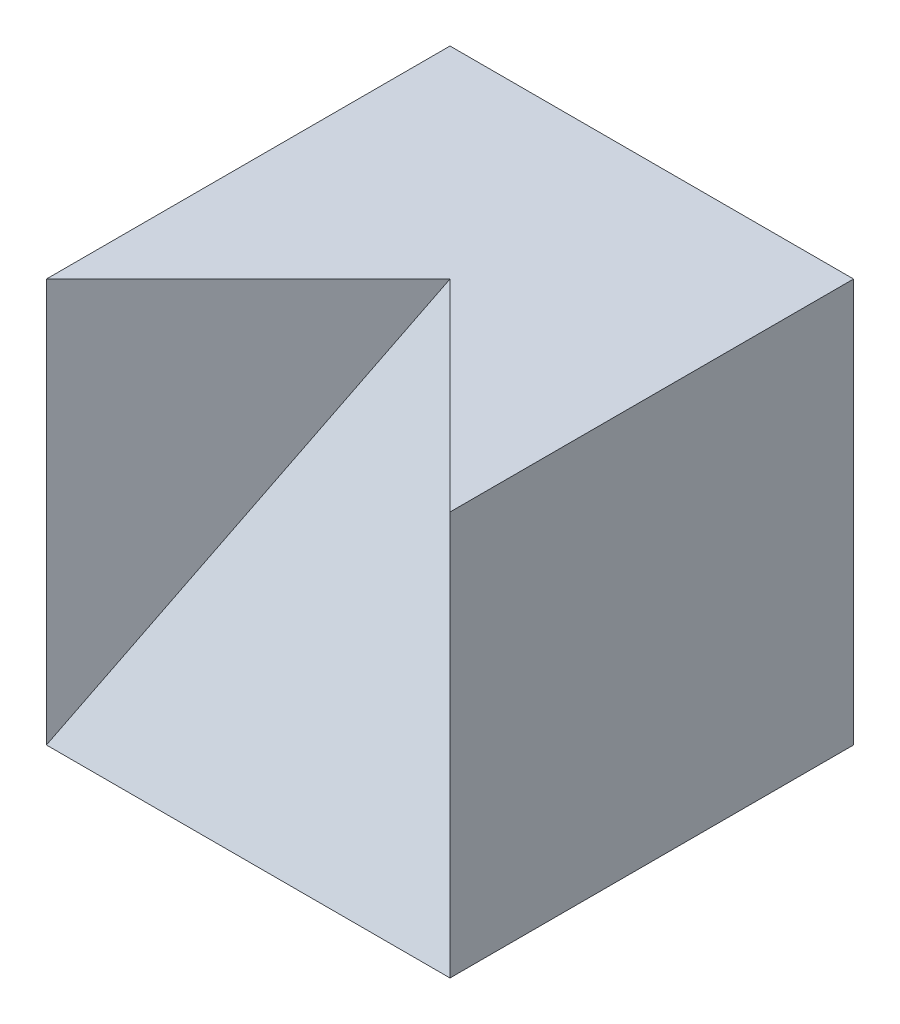
ISO-10303-21;
HEADER;
FILE_DESCRIPTION(('STEP AP214'),'2;1');
FILE_NAME('part.step','',(''),(''),'','','');
FILE_SCHEMA(('AUTOMOTIVE_DESIGN { 1 0 10303 214 1 1 1 1 }'));
ENDSEC;
DATA;
#1=APPLICATION_CONTEXT('core data for automotive mechanical design processes');
#2=APPLICATION_PROTOCOL_DEFINITION('international standard','automotive_design',2000,#1);
#3=PRODUCT_CONTEXT('',#1,'mechanical');
#4=PRODUCT('Part','Part','',(#3));
#5=PRODUCT_RELATED_PRODUCT_CATEGORY('part','',(#4));
#6=PRODUCT_DEFINITION_FORMATION('','',#4);
#7=PRODUCT_DEFINITION_CONTEXT('part definition',#1,'design');
#8=PRODUCT_DEFINITION('design','',#6,#7);
#9=PRODUCT_DEFINITION_SHAPE('','',#8);
#10=(LENGTH_UNIT() NAMED_UNIT(*) SI_UNIT(.MILLI.,.METRE.));
#11=(NAMED_UNIT(*) PLANE_ANGLE_UNIT() SI_UNIT($,.RADIAN.));
#12=(NAMED_UNIT(*) SI_UNIT($,.STERADIAN.) SOLID_ANGLE_UNIT());
#13=UNCERTAINTY_MEASURE_WITH_UNIT(LENGTH_MEASURE(1.E-05),#10,'distance_accuracy_value','');
#14=(GEOMETRIC_REPRESENTATION_CONTEXT(3) GLOBAL_UNCERTAINTY_ASSIGNED_CONTEXT((#13)) GLOBAL_UNIT_ASSIGNED_CONTEXT((#10,
#11,#12)) REPRESENTATION_CONTEXT('',''));
#15=CARTESIAN_POINT('',(0.,0.,0.));
#16=DIRECTION('',(0.,0.,1.));
#17=DIRECTION('',(1.,0.,0.));
#18=AXIS2_PLACEMENT_3D('',#15,#16,#17);
#19=CARTESIAN_POINT('',(2.,4.,2.));
#20=DIRECTION('',(-1.,0.,0.));
#21=DIRECTION('',(0.,0.,1.));
#22=AXIS2_PLACEMENT_3D('',#19,#20,#21);
#23=PLANE('',#22);
#24=DIRECTION('',(0.,0.,-1.));
#25=VECTOR('',#24,1.);
#26=CARTESIAN_POINT('',(2.,0.,2.));
#27=LINE('',#26,#25);
#28=CARTESIAN_POINT('',(2.,0.,2.));
#29=VERTEX_POINT('',#28);
#30=CARTESIAN_POINT('',(2.,0.,-2.));
#31=VERTEX_POINT('',#30);
#32=EDGE_CURVE('E101',#29,#31,#27,.T.);
#33=ORIENTED_EDGE('',*,*,#32,.T.);
#34=DIRECTION('',(0.,-1.,0.));
#35=VECTOR('',#34,1.);
#36=CARTESIAN_POINT('',(2.,4.,-2.));
#37=LINE('',#36,#35);
#38=CARTESIAN_POINT('',(2.,4.,-2.));
#39=VERTEX_POINT('',#38);
#40=EDGE_CURVE('E12',#39,#31,#37,.T.);
#41=ORIENTED_EDGE('',*,*,#40,.F.);
#42=DIRECTION('',(0.,0.,-1.));
#43=VECTOR('',#42,1.);
#44=CARTESIAN_POINT('',(2.,4.,2.));
#45=LINE('',#44,#43);
#46=CARTESIAN_POINT('',(2.,4.,2.));
#47=VERTEX_POINT('',#46);
#48=EDGE_CURVE('E102',#47,#39,#45,.T.);
#49=ORIENTED_EDGE('',*,*,#48,.F.);
#50=DIRECTION('',(0.,-1.,0.));
#51=VECTOR('',#50,1.);
#52=CARTESIAN_POINT('',(2.,4.,2.));
#53=LINE('',#52,#51);
#54=EDGE_CURVE('E91',#47,#29,#53,.T.);
#55=ORIENTED_EDGE('',*,*,#54,.T.);
#56=EDGE_LOOP('',(#33,#41,#49,#55));
#57=FACE_BOUND('',#56,.T.);
#58=ADVANCED_FACE('F34',(#57),#23,.F.);
#59=CARTESIAN_POINT('',(-2.,4.,-2.));
#60=DIRECTION('',(0.,0.,1.));
#61=DIRECTION('',(1.,0.,0.));
#62=AXIS2_PLACEMENT_3D('',#59,#60,#61);
#63=PLANE('',#62);
#64=DIRECTION('',(-1.,0.,0.));
#65=VECTOR('',#64,1.);
#66=CARTESIAN_POINT('',(-2.,0.,-2.));
#67=LINE('',#66,#65);
#68=CARTESIAN_POINT('',(-2.,0.,-2.));
#69=VERTEX_POINT('',#68);
#70=EDGE_CURVE('E63',#31,#69,#67,.T.);
#71=ORIENTED_EDGE('',*,*,#70,.T.);
#72=DIRECTION('',(0.,-1.,0.));
#73=VECTOR('',#72,1.);
#74=CARTESIAN_POINT('',(-2.,4.,-2.));
#75=LINE('',#74,#73);
#76=CARTESIAN_POINT('',(-2.,4.,-2.));
#77=VERTEX_POINT('',#76);
#78=EDGE_CURVE('E43',#77,#69,#75,.T.);
#79=ORIENTED_EDGE('',*,*,#78,.F.);
#80=DIRECTION('',(-1.,0.,0.));
#81=VECTOR('',#80,1.);
#82=CARTESIAN_POINT('',(-2.,4.,-2.));
#83=LINE('',#82,#81);
#84=EDGE_CURVE('E52',#39,#77,#83,.T.);
#85=ORIENTED_EDGE('',*,*,#84,.F.);
#86=ORIENTED_EDGE('',*,*,#40,.T.);
#87=EDGE_LOOP('',(#71,#79,#85,#86));
#88=FACE_BOUND('',#87,.T.);
#89=ADVANCED_FACE('F145',(#88),#63,.F.);
#90=CARTESIAN_POINT('',(-2.,4.,2.));
#91=DIRECTION('',(1.,0.,0.));
#92=DIRECTION('',(0.,0.,-1.));
#93=AXIS2_PLACEMENT_3D('',#90,#91,#92);
#94=PLANE('',#93);
#95=DIRECTION('',(0.,0.,1.));
#96=VECTOR('',#95,1.);
#97=CARTESIAN_POINT('',(-2.,0.,2.));
#98=LINE('',#97,#96);
#99=CARTESIAN_POINT('',(-2.,0.,2.));
#100=VERTEX_POINT('',#99);
#101=EDGE_CURVE('E94',#69,#100,#98,.T.);
#102=ORIENTED_EDGE('',*,*,#101,.T.);
#103=DIRECTION('',(0.,-1.,0.));
#104=VECTOR('',#103,1.);
#105=CARTESIAN_POINT('',(-2.,4.,2.));
#106=LINE('',#105,#104);
#107=CARTESIAN_POINT('',(-2.,4.,2.));
#108=VERTEX_POINT('',#107);
#109=EDGE_CURVE('E84',#108,#100,#106,.T.);
#110=ORIENTED_EDGE('',*,*,#109,.F.);
#111=DIRECTION('',(0.,0.,1.));
#112=VECTOR('',#111,1.);
#113=CARTESIAN_POINT('',(-2.,4.,2.));
#114=LINE('',#113,#112);
#115=EDGE_CURVE('E111',#77,#108,#114,.T.);
#116=ORIENTED_EDGE('',*,*,#115,.F.);
#117=ORIENTED_EDGE('',*,*,#78,.T.);
#118=EDGE_LOOP('',(#102,#110,#116,#117));
#119=FACE_BOUND('',#118,.T.);
#120=ADVANCED_FACE('F95',(#119),#94,.F.);
#121=CARTESIAN_POINT('',(0.,4.,0.));
#122=DIRECTION('',(0.,-1.,0.));
#123=DIRECTION('',(0.,0.,-1.));
#124=AXIS2_PLACEMENT_3D('',#121,#122,#123);
#125=PLANE('',#124);
#126=ORIENTED_EDGE('',*,*,#115,.T.);
#127=DIRECTION('',(0.707106781186548,0.,-0.707106781186548));
#128=VECTOR('',#127,1.);
#129=CARTESIAN_POINT('',(0.,4.,0.));
#130=LINE('',#129,#128);
#131=CARTESIAN_POINT('',(0.,4.,0.));
#132=VERTEX_POINT('',#131);
#133=EDGE_CURVE('E88',#108,#132,#130,.T.);
#134=ORIENTED_EDGE('',*,*,#133,.T.);
#135=DIRECTION('',(0.707106781186548,0.,0.707106781186548));
#136=VECTOR('',#135,1.);
#137=CARTESIAN_POINT('',(0.,4.,0.));
#138=LINE('',#137,#136);
#139=EDGE_CURVE('E127',#132,#47,#138,.T.);
#140=ORIENTED_EDGE('',*,*,#139,.T.);
#141=ORIENTED_EDGE('',*,*,#48,.T.);
#142=ORIENTED_EDGE('',*,*,#84,.T.);
#143=EDGE_LOOP('',(#126,#134,#140,#141,#142));
#144=FACE_BOUND('',#143,.T.);
#145=ADVANCED_FACE('F139',(#144),#125,.F.);
#146=CARTESIAN_POINT('',(0.,0.,0.));
#147=DIRECTION('',(0.,-1.,0.));
#148=DIRECTION('',(0.,0.,-1.));
#149=AXIS2_PLACEMENT_3D('',#146,#147,#148);
#150=PLANE('',#149);
#151=ORIENTED_EDGE('',*,*,#32,.F.);
#152=DIRECTION('',(1.,0.,0.));
#153=VECTOR('',#152,1.);
#154=CARTESIAN_POINT('',(-2.,0.,2.));
#155=LINE('',#154,#153);
#156=EDGE_CURVE('E75',#100,#29,#155,.T.);
#157=ORIENTED_EDGE('',*,*,#156,.F.);
#158=ORIENTED_EDGE('',*,*,#101,.F.);
#159=ORIENTED_EDGE('',*,*,#70,.F.);
#160=EDGE_LOOP('',(#151,#157,#158,#159));
#161=FACE_BOUND('',#160,.T.);
#162=ADVANCED_FACE('F99',(#161),#150,.T.);
#163=CARTESIAN_POINT('',(0.,4.,0.));
#164=DIRECTION('',(-0.707106781186547,0.,-0.707106781186547));
#165=DIRECTION('',(-0.707106781186548,0.,0.707106781186548));
#166=AXIS2_PLACEMENT_3D('',#163,#164,#165);
#167=PLANE('',#166);
#168=ORIENTED_EDGE('',*,*,#109,.T.);
#169=DIRECTION('',(-0.408248290463863,-0.816496580927726,0.408248290463863));
#170=VECTOR('',#169,1.);
#171=CARTESIAN_POINT('',(0.,4.,0.));
#172=LINE('',#171,#170);
#173=EDGE_CURVE('E70',#132,#100,#172,.T.);
#174=ORIENTED_EDGE('',*,*,#173,.F.);
#175=ORIENTED_EDGE('',*,*,#133,.F.);
#176=EDGE_LOOP('',(#168,#174,#175));
#177=FACE_BOUND('',#176,.T.);
#178=ADVANCED_FACE('F86',(#177),#167,.F.);
#179=CARTESIAN_POINT('',(2.,0.,2.));
#180=DIRECTION('',(0.707106781186547,0.,-0.707106781186547));
#181=DIRECTION('',(-0.707106781186548,0.,-0.707106781186548));
#182=AXIS2_PLACEMENT_3D('',#179,#180,#181);
#183=PLANE('',#182);
#184=DIRECTION('',(-0.408248290463863,0.816496580927726,-0.408248290463863));
#185=VECTOR('',#184,1.);
#186=CARTESIAN_POINT('',(2.,0.,2.));
#187=LINE('',#186,#185);
#188=EDGE_CURVE('E78',#29,#132,#187,.T.);
#189=ORIENTED_EDGE('',*,*,#188,.F.);
#190=ORIENTED_EDGE('',*,*,#54,.F.);
#191=ORIENTED_EDGE('',*,*,#139,.F.);
#192=EDGE_LOOP('',(#189,#190,#191));
#193=FACE_BOUND('',#192,.T.);
#194=ADVANCED_FACE('F159',(#193),#183,.F.);
#195=CARTESIAN_POINT('',(0.,0.800000000000001,1.6));
#196=DIRECTION('',(0.,0.447213595499958,0.894427190999916));
#197=DIRECTION('',(0.,-0.894427190999916,0.447213595499958));
#198=AXIS2_PLACEMENT_3D('',#195,#196,#197);
#199=PLANE('',#198);
#200=ORIENTED_EDGE('',*,*,#173,.T.);
#201=ORIENTED_EDGE('',*,*,#156,.T.);
#202=ORIENTED_EDGE('',*,*,#188,.T.);
#203=EDGE_LOOP('',(#200,#201,#202));
#204=FACE_BOUND('',#203,.T.);
#205=ADVANCED_FACE('F72',(#204),#199,.T.);
#206=CLOSED_SHELL('',(#58,#89,#120,#145,#162,#178,#194,#205));
#207=MANIFOLD_SOLID_BREP('B2',#206);
#208=ADVANCED_BREP_SHAPE_REPRESENTATION('',(#18,#207),#14);
#209=SHAPE_DEFINITION_REPRESENTATION(#9,#208);
ENDSEC;
END-ISO-10303-21;
